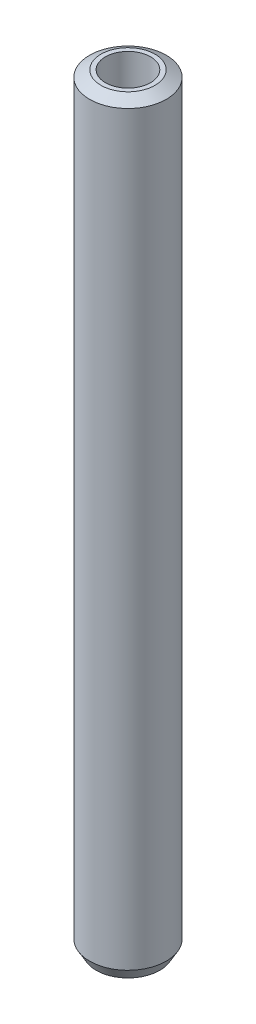
ISO-10303-21;
HEADER;
FILE_DESCRIPTION(('STEP AP214'),'2;1');
FILE_NAME('part.step','',(''),(''),'','','');
FILE_SCHEMA(('AUTOMOTIVE_DESIGN { 1 0 10303 214 1 1 1 1 }'));
ENDSEC;
DATA;
#1=APPLICATION_CONTEXT('core data for automotive mechanical design processes');
#2=APPLICATION_PROTOCOL_DEFINITION('international standard','automotive_design',2000,#1);
#3=PRODUCT_CONTEXT('',#1,'mechanical');
#4=PRODUCT('Part','Part','',(#3));
#5=PRODUCT_RELATED_PRODUCT_CATEGORY('part','',(#4));
#6=PRODUCT_DEFINITION_FORMATION('','',#4);
#7=PRODUCT_DEFINITION_CONTEXT('part definition',#1,'design');
#8=PRODUCT_DEFINITION('design','',#6,#7);
#9=PRODUCT_DEFINITION_SHAPE('','',#8);
#10=(LENGTH_UNIT() NAMED_UNIT(*) SI_UNIT(.MILLI.,.METRE.));
#11=(NAMED_UNIT(*) PLANE_ANGLE_UNIT() SI_UNIT($,.RADIAN.));
#12=(NAMED_UNIT(*) SI_UNIT($,.STERADIAN.) SOLID_ANGLE_UNIT());
#13=UNCERTAINTY_MEASURE_WITH_UNIT(LENGTH_MEASURE(1.E-05),#10,'distance_accuracy_value','');
#14=(GEOMETRIC_REPRESENTATION_CONTEXT(3) GLOBAL_UNCERTAINTY_ASSIGNED_CONTEXT((#13)) GLOBAL_UNIT_ASSIGNED_CONTEXT((#10,
#11,#12)) REPRESENTATION_CONTEXT('',''));
#15=CARTESIAN_POINT('',(0.,0.,0.));
#16=DIRECTION('',(0.,0.,1.));
#17=DIRECTION('',(1.,0.,0.));
#18=AXIS2_PLACEMENT_3D('',#15,#16,#17);
#19=CARTESIAN_POINT('',(0.,598.488150803998,0.));
#20=DIRECTION('',(0.,-1.,0.));
#21=DIRECTION('',(0.,0.,-1.));
#22=AXIS2_PLACEMENT_3D('',#19,#20,#21);
#23=CYLINDRICAL_SURFACE('',#22,30.);
#24=CARTESIAN_POINT('',(0.,593.387997517571,0.));
#25=DIRECTION('',(0.,1.,0.));
#26=DIRECTION('',(0.,0.,1.));
#27=AXIS2_PLACEMENT_3D('',#24,#25,#26);
#28=CIRCLE('',#27,30.);
#29=CARTESIAN_POINT('',(0.,593.387997517571,30.));
#30=VERTEX_POINT('',#29);
#31=EDGE_CURVE('E50',#30,#30,#28,.F.);
#32=ORIENTED_EDGE('',*,*,#31,.T.);
#33=EDGE_LOOP('',(#32));
#34=FACE_BOUND('',#33,.T.);
#35=CARTESIAN_POINT('',(0.,8.83372461848086,0.));
#36=DIRECTION('',(0.,1.,0.));
#37=DIRECTION('',(0.,0.,1.));
#38=AXIS2_PLACEMENT_3D('',#35,#36,#37);
#39=CIRCLE('',#38,30.);
#40=CARTESIAN_POINT('',(0.,8.83372461848086,30.));
#41=VERTEX_POINT('',#40);
#42=EDGE_CURVE('E51',#41,#41,#39,.T.);
#43=ORIENTED_EDGE('',*,*,#42,.T.);
#44=EDGE_LOOP('',(#43));
#45=FACE_BOUND('',#44,.T.);
#46=ADVANCED_FACE('F39',(#34,#45),#23,.T.);
#47=CARTESIAN_POINT('',(0.,598.488150803998,0.));
#48=DIRECTION('',(0.,1.,0.));
#49=DIRECTION('',(0.,0.,1.));
#50=AXIS2_PLACEMENT_3D('',#47,#48,#49);
#51=PLANE('',#50);
#52=CARTESIAN_POINT('',(0.,598.488150803998,0.));
#53=DIRECTION('',(0.,1.,0.));
#54=DIRECTION('',(0.,0.,1.));
#55=AXIS2_PLACEMENT_3D('',#52,#53,#54);
#56=CIRCLE('',#55,21.1662753815189);
#57=CARTESIAN_POINT('',(0.,598.488150803998,21.1662753815189));
#58=VERTEX_POINT('',#57);
#59=EDGE_CURVE('E54',#58,#58,#56,.T.);
#60=ORIENTED_EDGE('',*,*,#59,.T.);
#61=EDGE_LOOP('',(#60));
#62=FACE_BOUND('',#61,.T.);
#63=CARTESIAN_POINT('',(0.,598.488150803998,0.));
#64=DIRECTION('',(0.,1.,0.));
#65=DIRECTION('',(0.,0.,1.));
#66=AXIS2_PLACEMENT_3D('',#63,#64,#65);
#67=CIRCLE('',#66,17.641366552238);
#68=CARTESIAN_POINT('',(0.,598.488150803998,17.641366552238));
#69=VERTEX_POINT('',#68);
#70=EDGE_CURVE('E58',#69,#69,#67,.T.);
#71=ORIENTED_EDGE('',*,*,#70,.F.);
#72=EDGE_LOOP('',(#71));
#73=FACE_BOUND('',#72,.T.);
#74=ADVANCED_FACE('F69',(#62,#73),#51,.T.);
#75=CARTESIAN_POINT('',(0.,0.,0.));
#76=DIRECTION('',(0.,1.,0.));
#77=DIRECTION('',(0.,0.,1.));
#78=AXIS2_PLACEMENT_3D('',#75,#76,#77);
#79=PLANE('',#78);
#80=CARTESIAN_POINT('',(0.,0.,0.));
#81=DIRECTION('',(0.,1.,0.));
#82=DIRECTION('',(0.,0.,1.));
#83=AXIS2_PLACEMENT_3D('',#80,#81,#82);
#84=CIRCLE('',#83,24.899846713573);
#85=CARTESIAN_POINT('',(0.,0.,24.899846713573));
#86=VERTEX_POINT('',#85);
#87=EDGE_CURVE('E10',#86,#86,#84,.F.);
#88=ORIENTED_EDGE('',*,*,#87,.T.);
#89=EDGE_LOOP('',(#88));
#90=FACE_BOUND('',#89,.T.);
#91=CARTESIAN_POINT('',(0.,0.,0.));
#92=DIRECTION('',(0.,1.,0.));
#93=DIRECTION('',(0.,0.,1.));
#94=AXIS2_PLACEMENT_3D('',#91,#92,#93);
#95=CIRCLE('',#94,17.641366552238);
#96=CARTESIAN_POINT('',(0.,0.,17.641366552238));
#97=VERTEX_POINT('',#96);
#98=EDGE_CURVE('E63',#97,#97,#95,.T.);
#99=ORIENTED_EDGE('',*,*,#98,.T.);
#100=EDGE_LOOP('',(#99));
#101=FACE_BOUND('',#100,.T.);
#102=ADVANCED_FACE('F75',(#90,#101),#79,.F.);
#103=CARTESIAN_POINT('',(0.,598.488150803998,0.));
#104=DIRECTION('',(0.,-1.,0.));
#105=DIRECTION('',(0.,0.,-1.));
#106=AXIS2_PLACEMENT_3D('',#103,#104,#105);
#107=CYLINDRICAL_SURFACE('',#106,17.641366552238);
#108=ORIENTED_EDGE('',*,*,#70,.T.);
#109=EDGE_LOOP('',(#108));
#110=FACE_BOUND('',#109,.T.);
#111=ORIENTED_EDGE('',*,*,#98,.F.);
#112=EDGE_LOOP('',(#111));
#113=FACE_BOUND('',#112,.T.);
#114=ADVANCED_FACE('F70',(#110,#113),#107,.F.);
#115=CARTESIAN_POINT('',(0.,598.488150803998,0.));
#116=DIRECTION('',(0.,-1.,0.));
#117=DIRECTION('',(0.,0.,-1.));
#118=AXIS2_PLACEMENT_3D('',#115,#116,#117);
#119=CONICAL_SURFACE('',#118,21.1662753815189,1.0471975511966);
#120=ORIENTED_EDGE('',*,*,#31,.F.);
#121=EDGE_LOOP('',(#120));
#122=FACE_BOUND('',#121,.T.);
#123=ORIENTED_EDGE('',*,*,#59,.F.);
#124=EDGE_LOOP('',(#123));
#125=FACE_BOUND('',#124,.T.);
#126=ADVANCED_FACE('F81',(#122,#125),#119,.T.);
#127=CARTESIAN_POINT('',(0.,8.83372461848086,0.));
#128=DIRECTION('',(0.,1.,0.));
#129=DIRECTION('',(0.,0.,1.));
#130=AXIS2_PLACEMENT_3D('',#127,#128,#129);
#131=CONICAL_SURFACE('',#130,30.,0.523598775598304);
#132=ORIENTED_EDGE('',*,*,#87,.F.);
#133=EDGE_LOOP('',(#132));
#134=FACE_BOUND('',#133,.T.);
#135=ORIENTED_EDGE('',*,*,#42,.F.);
#136=EDGE_LOOP('',(#135));
#137=FACE_BOUND('',#136,.T.);
#138=ADVANCED_FACE('F45',(#134,#137),#131,.T.);
#139=CLOSED_SHELL('',(#46,#74,#102,#114,#126,#138));
#140=MANIFOLD_SOLID_BREP('B2',#139);
#141=ADVANCED_BREP_SHAPE_REPRESENTATION('',(#18,#140),#14);
#142=SHAPE_DEFINITION_REPRESENTATION(#9,#141);
ENDSEC;
END-ISO-10303-21;
